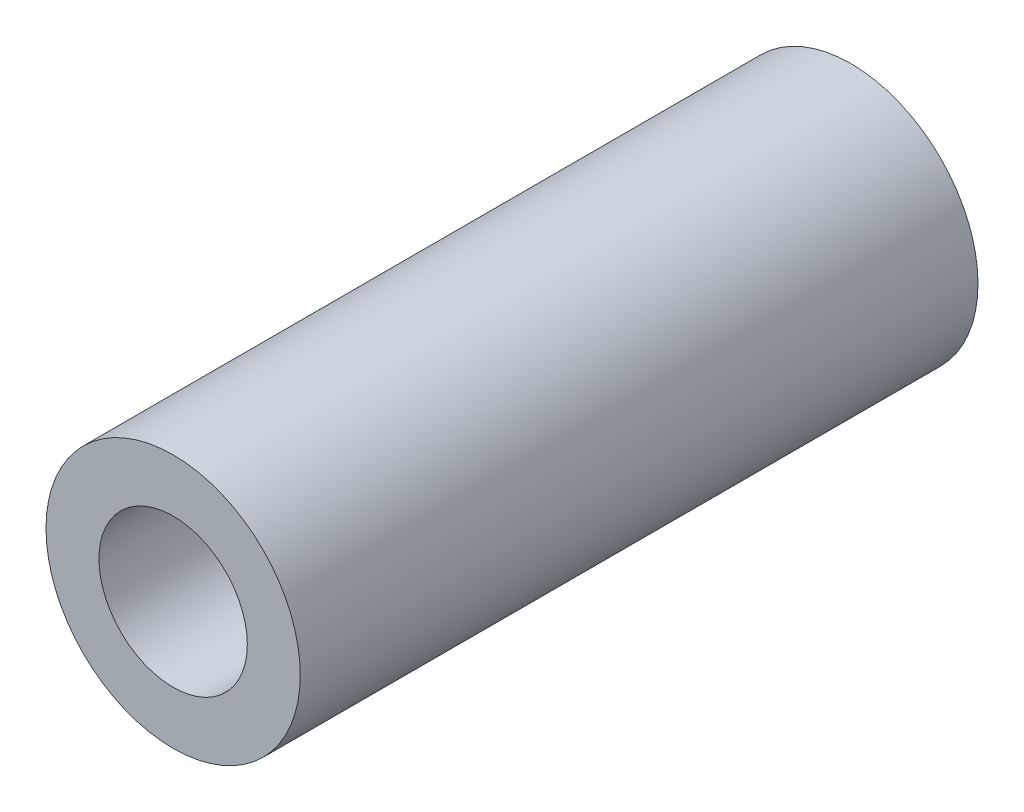
ISO-10303-21;
HEADER;
FILE_DESCRIPTION(('STEP AP214'),'2;1');
FILE_NAME('part.step','',(''),(''),'','','');
FILE_SCHEMA(('AUTOMOTIVE_DESIGN { 1 0 10303 214 1 1 1 1 }'));
ENDSEC;
DATA;
#1=APPLICATION_CONTEXT('core data for automotive mechanical design processes');
#2=APPLICATION_PROTOCOL_DEFINITION('international standard','automotive_design',2000,#1);
#3=PRODUCT_CONTEXT('',#1,'mechanical');
#4=PRODUCT('Part','Part','',(#3));
#5=PRODUCT_RELATED_PRODUCT_CATEGORY('part','',(#4));
#6=PRODUCT_DEFINITION_FORMATION('','',#4);
#7=PRODUCT_DEFINITION_CONTEXT('part definition',#1,'design');
#8=PRODUCT_DEFINITION('design','',#6,#7);
#9=PRODUCT_DEFINITION_SHAPE('','',#8);
#10=(LENGTH_UNIT() NAMED_UNIT(*) SI_UNIT(.MILLI.,.METRE.));
#11=(NAMED_UNIT(*) PLANE_ANGLE_UNIT() SI_UNIT($,.RADIAN.));
#12=(NAMED_UNIT(*) SI_UNIT($,.STERADIAN.) SOLID_ANGLE_UNIT());
#13=UNCERTAINTY_MEASURE_WITH_UNIT(LENGTH_MEASURE(1.E-05),#10,'distance_accuracy_value','');
#14=(GEOMETRIC_REPRESENTATION_CONTEXT(3) GLOBAL_UNCERTAINTY_ASSIGNED_CONTEXT((#13)) GLOBAL_UNIT_ASSIGNED_CONTEXT((#10,
#11,#12)) REPRESENTATION_CONTEXT('',''));
#15=CARTESIAN_POINT('',(0.,0.,0.));
#16=DIRECTION('',(0.,0.,1.));
#17=DIRECTION('',(1.,0.,0.));
#18=AXIS2_PLACEMENT_3D('',#15,#16,#17);
#19=CARTESIAN_POINT('',(0.,0.,0.));
#20=DIRECTION('',(0.,0.,1.));
#21=DIRECTION('',(1.,0.,0.));
#22=AXIS2_PLACEMENT_3D('',#19,#20,#21);
#23=CYLINDRICAL_SURFACE('',#22,2.78);
#24=CARTESIAN_POINT('',(0.,0.,0.));
#25=DIRECTION('',(0.,0.,1.));
#26=DIRECTION('',(1.,0.,0.));
#27=AXIS2_PLACEMENT_3D('',#24,#25,#26);
#28=CIRCLE('',#27,2.78);
#29=CARTESIAN_POINT('',(2.78,0.,0.));
#30=VERTEX_POINT('',#29);
#31=EDGE_CURVE('E26',#30,#30,#28,.F.);
#32=ORIENTED_EDGE('',*,*,#31,.T.);
#33=EDGE_LOOP('',(#32));
#34=FACE_BOUND('',#33,.T.);
#35=CARTESIAN_POINT('',(0.,0.,25.4));
#36=DIRECTION('',(0.,0.,1.));
#37=DIRECTION('',(1.,0.,0.));
#38=AXIS2_PLACEMENT_3D('',#35,#36,#37);
#39=CIRCLE('',#38,2.78);
#40=CARTESIAN_POINT('',(2.78,0.,25.4));
#41=VERTEX_POINT('',#40);
#42=EDGE_CURVE('E17',#41,#41,#39,.F.);
#43=ORIENTED_EDGE('',*,*,#42,.F.);
#44=EDGE_LOOP('',(#43));
#45=FACE_BOUND('',#44,.T.);
#46=ADVANCED_FACE('F14',(#34,#45),#23,.F.);
#47=CARTESIAN_POINT('',(0.,0.,25.4));
#48=DIRECTION('',(0.,0.,1.));
#49=DIRECTION('',(1.,0.,0.));
#50=AXIS2_PLACEMENT_3D('',#47,#48,#49);
#51=PLANE('',#50);
#52=CARTESIAN_POINT('',(0.,0.,25.4));
#53=DIRECTION('',(0.,0.,1.));
#54=DIRECTION('',(1.,0.,0.));
#55=AXIS2_PLACEMENT_3D('',#52,#53,#54);
#56=CIRCLE('',#55,4.765);
#57=CARTESIAN_POINT('',(4.765,0.,25.4));
#58=VERTEX_POINT('',#57);
#59=EDGE_CURVE('E21',#58,#58,#56,.F.);
#60=ORIENTED_EDGE('',*,*,#59,.F.);
#61=EDGE_LOOP('',(#60));
#62=FACE_BOUND('',#61,.T.);
#63=ORIENTED_EDGE('',*,*,#42,.T.);
#64=EDGE_LOOP('',(#63));
#65=FACE_BOUND('',#64,.T.);
#66=ADVANCED_FACE('F34',(#62,#65),#51,.T.);
#67=CARTESIAN_POINT('',(0.,0.,0.));
#68=DIRECTION('',(0.,0.,1.));
#69=DIRECTION('',(1.,0.,0.));
#70=AXIS2_PLACEMENT_3D('',#67,#68,#69);
#71=PLANE('',#70);
#72=CARTESIAN_POINT('',(0.,0.,0.));
#73=DIRECTION('',(0.,0.,1.));
#74=DIRECTION('',(1.,0.,0.));
#75=AXIS2_PLACEMENT_3D('',#72,#73,#74);
#76=CIRCLE('',#75,4.765);
#77=CARTESIAN_POINT('',(4.765,0.,0.));
#78=VERTEX_POINT('',#77);
#79=EDGE_CURVE('E10',#78,#78,#76,.T.);
#80=ORIENTED_EDGE('',*,*,#79,.F.);
#81=EDGE_LOOP('',(#80));
#82=FACE_BOUND('',#81,.T.);
#83=ORIENTED_EDGE('',*,*,#31,.F.);
#84=EDGE_LOOP('',(#83));
#85=FACE_BOUND('',#84,.T.);
#86=ADVANCED_FACE('F41',(#82,#85),#71,.F.);
#87=CARTESIAN_POINT('',(0.,0.,0.));
#88=DIRECTION('',(0.,0.,1.));
#89=DIRECTION('',(1.,0.,0.));
#90=AXIS2_PLACEMENT_3D('',#87,#88,#89);
#91=CYLINDRICAL_SURFACE('',#90,4.765);
#92=ORIENTED_EDGE('',*,*,#79,.T.);
#93=EDGE_LOOP('',(#92));
#94=FACE_BOUND('',#93,.T.);
#95=ORIENTED_EDGE('',*,*,#59,.T.);
#96=EDGE_LOOP('',(#95));
#97=FACE_BOUND('',#96,.T.);
#98=ADVANCED_FACE('F43',(#94,#97),#91,.T.);
#99=CLOSED_SHELL('',(#46,#66,#86,#98));
#100=MANIFOLD_SOLID_BREP('B1',#99);
#101=ADVANCED_BREP_SHAPE_REPRESENTATION('',(#18,#100),#14);
#102=SHAPE_DEFINITION_REPRESENTATION(#9,#101);
ENDSEC;
END-ISO-10303-21;
